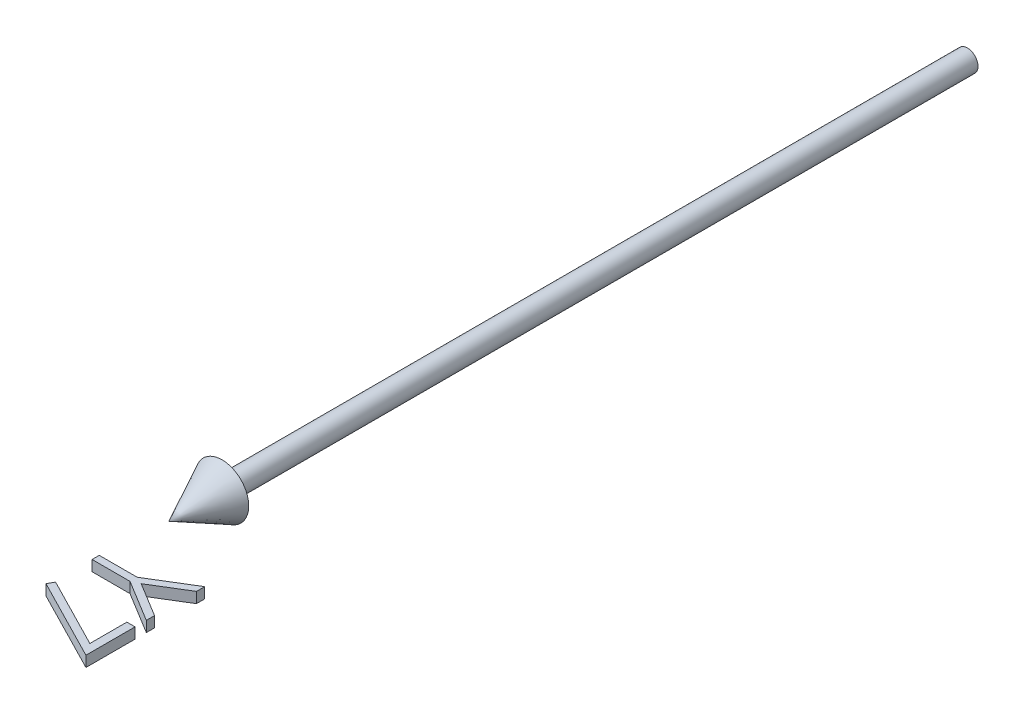
ISO-10303-21;
HEADER;
FILE_DESCRIPTION(('STEP AP214'),'2;1');
FILE_NAME('part.step','',(''),(''),'','','');
FILE_SCHEMA(('AUTOMOTIVE_DESIGN { 1 0 10303 214 1 1 1 1 }'));
ENDSEC;
DATA;
#1=APPLICATION_CONTEXT('core data for automotive mechanical design processes');
#2=APPLICATION_PROTOCOL_DEFINITION('international standard','automotive_design',2000,#1);
#3=PRODUCT_CONTEXT('',#1,'mechanical');
#4=PRODUCT('Part','Part','',(#3));
#5=PRODUCT_RELATED_PRODUCT_CATEGORY('part','',(#4));
#6=PRODUCT_DEFINITION_FORMATION('','',#4);
#7=PRODUCT_DEFINITION_CONTEXT('part definition',#1,'design');
#8=PRODUCT_DEFINITION('design','',#6,#7);
#9=PRODUCT_DEFINITION_SHAPE('','',#8);
#10=(LENGTH_UNIT() NAMED_UNIT(*) SI_UNIT(.MILLI.,.METRE.));
#11=(NAMED_UNIT(*) PLANE_ANGLE_UNIT() SI_UNIT($,.RADIAN.));
#12=(NAMED_UNIT(*) SI_UNIT($,.STERADIAN.) SOLID_ANGLE_UNIT());
#13=UNCERTAINTY_MEASURE_WITH_UNIT(LENGTH_MEASURE(1.E-05),#10,'distance_accuracy_value','');
#14=(GEOMETRIC_REPRESENTATION_CONTEXT(3) GLOBAL_UNCERTAINTY_ASSIGNED_CONTEXT((#13)) GLOBAL_UNIT_ASSIGNED_CONTEXT((#10,
#11,#12)) REPRESENTATION_CONTEXT('',''));
#15=CARTESIAN_POINT('',(0.,0.,0.));
#16=DIRECTION('',(0.,0.,1.));
#17=DIRECTION('',(1.,0.,0.));
#18=AXIS2_PLACEMENT_3D('',#15,#16,#17);
#19=CARTESIAN_POINT('',(13.4615384615385,1.,171.346153846154));
#20=DIRECTION('',(0.,0.,-1.));
#21=DIRECTION('',(-1.,0.,0.));
#22=AXIS2_PLACEMENT_3D('',#19,#20,#21);
#23=PLANE('',#22);
#24=DIRECTION('',(0.,-1.,0.));
#25=VECTOR('',#24,1.);
#26=CARTESIAN_POINT('',(15.,1.,171.346153846154));
#27=LINE('',#26,#25);
#28=CARTESIAN_POINT('',(15.,1.,171.346153846154));
#29=VERTEX_POINT('',#28);
#30=CARTESIAN_POINT('',(15.,-1.,171.346153846154));
#31=VERTEX_POINT('',#30);
#32=EDGE_CURVE('E49',#29,#31,#27,.T.);
#33=ORIENTED_EDGE('',*,*,#32,.T.);
#34=DIRECTION('',(1.,0.,0.));
#35=VECTOR('',#34,1.);
#36=CARTESIAN_POINT('',(13.4615384615385,-1.,171.346153846154));
#37=LINE('',#36,#35);
#38=CARTESIAN_POINT('',(13.4615384615385,-1.,171.346153846154));
#39=VERTEX_POINT('',#38);
#40=EDGE_CURVE('E98',#39,#31,#37,.T.);
#41=ORIENTED_EDGE('',*,*,#40,.F.);
#42=DIRECTION('',(0.,-1.,0.));
#43=VECTOR('',#42,1.);
#44=CARTESIAN_POINT('',(13.4615384615385,1.,171.346153846154));
#45=LINE('',#44,#43);
#46=CARTESIAN_POINT('',(13.4615384615385,1.,171.346153846154));
#47=VERTEX_POINT('',#46);
#48=EDGE_CURVE('E12',#47,#39,#45,.T.);
#49=ORIENTED_EDGE('',*,*,#48,.F.);
#50=DIRECTION('',(1.,0.,0.));
#51=VECTOR('',#50,1.);
#52=CARTESIAN_POINT('',(13.4615384615385,1.,171.346153846154));
#53=LINE('',#52,#51);
#54=EDGE_CURVE('E99',#47,#29,#53,.T.);
#55=ORIENTED_EDGE('',*,*,#54,.T.);
#56=EDGE_LOOP('',(#33,#41,#49,#55));
#57=FACE_BOUND('',#56,.T.);
#58=ADVANCED_FACE('F46',(#57),#23,.T.);
#59=CARTESIAN_POINT('',(13.4615384615385,1.,178.299278846154));
#60=DIRECTION('',(-1.,0.,0.));
#61=DIRECTION('',(0.,0.,1.));
#62=AXIS2_PLACEMENT_3D('',#59,#60,#61);
#63=PLANE('',#62);
#64=ORIENTED_EDGE('',*,*,#48,.T.);
#65=DIRECTION('',(0.,0.,-1.));
#66=VECTOR('',#65,1.);
#67=CARTESIAN_POINT('',(13.4615384615385,-1.,178.299278846154));
#68=LINE('',#67,#66);
#69=CARTESIAN_POINT('',(13.4615384615385,-1.,178.299278846154));
#70=VERTEX_POINT('',#69);
#71=EDGE_CURVE('E116',#70,#39,#68,.T.);
#72=ORIENTED_EDGE('',*,*,#71,.F.);
#73=DIRECTION('',(0.,-1.,0.));
#74=VECTOR('',#73,1.);
#75=CARTESIAN_POINT('',(13.4615384615385,1.,178.299278846154));
#76=LINE('',#75,#74);
#77=CARTESIAN_POINT('',(13.4615384615385,1.,178.299278846154));
#78=VERTEX_POINT('',#77);
#79=EDGE_CURVE('E54',#78,#70,#76,.T.);
#80=ORIENTED_EDGE('',*,*,#79,.F.);
#81=DIRECTION('',(0.,0.,-1.));
#82=VECTOR('',#81,1.);
#83=CARTESIAN_POINT('',(13.4615384615385,1.,178.299278846154));
#84=LINE('',#83,#82);
#85=EDGE_CURVE('E104',#78,#47,#84,.T.);
#86=ORIENTED_EDGE('',*,*,#85,.T.);
#87=EDGE_LOOP('',(#64,#72,#80,#86));
#88=FACE_BOUND('',#87,.T.);
#89=ADVANCED_FACE('F156',(#88),#63,.T.);
#90=CARTESIAN_POINT('',(0.255408653846154,1.,171.529447115385));
#91=DIRECTION('',(0.456180989989926,0.,-0.889887017756643));
#92=DIRECTION('',(-0.889887017756643,0.,-0.456180989989926));
#93=AXIS2_PLACEMENT_3D('',#90,#91,#92);
#94=PLANE('',#93);
#95=ORIENTED_EDGE('',*,*,#79,.T.);
#96=DIRECTION('',(0.889887017756643,0.,0.456180989989926));
#97=VECTOR('',#96,1.);
#98=CARTESIAN_POINT('',(0.255408653846154,-1.,171.529447115385));
#99=LINE('',#98,#97);
#100=CARTESIAN_POINT('',(0.255408653846154,-1.,171.529447115385));
#101=VERTEX_POINT('',#100);
#102=EDGE_CURVE('E123',#101,#70,#99,.T.);
#103=ORIENTED_EDGE('',*,*,#102,.F.);
#104=DIRECTION('',(0.,-1.,0.));
#105=VECTOR('',#104,1.);
#106=CARTESIAN_POINT('',(0.255408653846154,1.,171.529447115385));
#107=LINE('',#106,#105);
#108=CARTESIAN_POINT('',(0.255408653846154,1.,171.529447115385));
#109=VERTEX_POINT('',#108);
#110=EDGE_CURVE('E139',#109,#101,#107,.T.);
#111=ORIENTED_EDGE('',*,*,#110,.F.);
#112=DIRECTION('',(0.889887017756643,0.,0.456180989989926));
#113=VECTOR('',#112,1.);
#114=CARTESIAN_POINT('',(0.255408653846154,1.,171.529447115385));
#115=LINE('',#114,#113);
#116=EDGE_CURVE('E135',#109,#78,#115,.T.);
#117=ORIENTED_EDGE('',*,*,#116,.T.);
#118=EDGE_LOOP('',(#95,#103,#111,#117));
#119=FACE_BOUND('',#118,.T.);
#120=ADVANCED_FACE('F152',(#119),#94,.T.);
#121=CARTESIAN_POINT('',(-0.384615384615385,1.,172.692307692308));
#122=DIRECTION('',(-0.876072484374681,0.,-0.482179429384513));
#123=DIRECTION('',(-0.482179429384513,0.,0.876072484374681));
#124=AXIS2_PLACEMENT_3D('',#121,#122,#123);
#125=PLANE('',#124);
#126=ORIENTED_EDGE('',*,*,#110,.T.);
#127=DIRECTION('',(0.482179429384513,0.,-0.876072484374681));
#128=VECTOR('',#127,1.);
#129=CARTESIAN_POINT('',(-0.384615384615385,-1.,172.692307692308));
#130=LINE('',#129,#128);
#131=CARTESIAN_POINT('',(-0.384615384615385,-1.,172.692307692308));
#132=VERTEX_POINT('',#131);
#133=EDGE_CURVE('E120',#132,#101,#130,.T.);
#134=ORIENTED_EDGE('',*,*,#133,.F.);
#135=DIRECTION('',(0.,-1.,0.));
#136=VECTOR('',#135,1.);
#137=CARTESIAN_POINT('',(-0.384615384615385,1.,172.692307692308));
#138=LINE('',#137,#136);
#139=CARTESIAN_POINT('',(-0.384615384615385,1.,172.692307692308));
#140=VERTEX_POINT('',#139);
#141=EDGE_CURVE('E141',#140,#132,#138,.T.);
#142=ORIENTED_EDGE('',*,*,#141,.F.);
#143=DIRECTION('',(0.482179429384513,0.,-0.876072484374681));
#144=VECTOR('',#143,1.);
#145=CARTESIAN_POINT('',(-0.384615384615385,1.,172.692307692308));
#146=LINE('',#145,#144);
#147=EDGE_CURVE('E132',#140,#109,#146,.T.);
#148=ORIENTED_EDGE('',*,*,#147,.T.);
#149=EDGE_LOOP('',(#126,#134,#142,#148));
#150=FACE_BOUND('',#149,.T.);
#151=ADVANCED_FACE('F149',(#150),#125,.T.);
#152=CARTESIAN_POINT('',(15.,1.,180.576923076923));
#153=DIRECTION('',(-0.4560907909104,0.,0.889933250556875));
#154=DIRECTION('',(0.889933250556875,0.,0.4560907909104));
#155=AXIS2_PLACEMENT_3D('',#152,#153,#154);
#156=PLANE('',#155);
#157=ORIENTED_EDGE('',*,*,#141,.T.);
#158=DIRECTION('',(-0.889933250556875,0.,-0.4560907909104));
#159=VECTOR('',#158,1.);
#160=CARTESIAN_POINT('',(15.,-1.,180.576923076923));
#161=LINE('',#160,#159);
#162=CARTESIAN_POINT('',(15.,-1.,180.576923076923));
#163=VERTEX_POINT('',#162);
#164=EDGE_CURVE('E111',#163,#132,#161,.T.);
#165=ORIENTED_EDGE('',*,*,#164,.F.);
#166=DIRECTION('',(0.,-1.,0.));
#167=VECTOR('',#166,1.);
#168=CARTESIAN_POINT('',(15.,1.,180.576923076923));
#169=LINE('',#168,#167);
#170=CARTESIAN_POINT('',(15.,1.,180.576923076923));
#171=VERTEX_POINT('',#170);
#172=EDGE_CURVE('E103',#171,#163,#169,.T.);
#173=ORIENTED_EDGE('',*,*,#172,.F.);
#174=DIRECTION('',(-0.889933250556875,0.,-0.4560907909104));
#175=VECTOR('',#174,1.);
#176=CARTESIAN_POINT('',(15.,1.,180.576923076923));
#177=LINE('',#176,#175);
#178=EDGE_CURVE('E129',#171,#140,#177,.T.);
#179=ORIENTED_EDGE('',*,*,#178,.T.);
#180=EDGE_LOOP('',(#157,#165,#173,#179));
#181=FACE_BOUND('',#180,.T.);
#182=ADVANCED_FACE('F143',(#181),#156,.T.);
#183=CARTESIAN_POINT('',(15.,1.,171.346153846154));
#184=DIRECTION('',(1.,0.,0.));
#185=DIRECTION('',(0.,0.,-1.));
#186=AXIS2_PLACEMENT_3D('',#183,#184,#185);
#187=PLANE('',#186);
#188=ORIENTED_EDGE('',*,*,#172,.T.);
#189=DIRECTION('',(0.,0.,1.));
#190=VECTOR('',#189,1.);
#191=CARTESIAN_POINT('',(15.,-1.,171.346153846154));
#192=LINE('',#191,#190);
#193=EDGE_CURVE('E106',#31,#163,#192,.T.);
#194=ORIENTED_EDGE('',*,*,#193,.F.);
#195=ORIENTED_EDGE('',*,*,#32,.F.);
#196=DIRECTION('',(0.,0.,1.));
#197=VECTOR('',#196,1.);
#198=CARTESIAN_POINT('',(15.,1.,171.346153846154));
#199=LINE('',#198,#197);
#200=EDGE_CURVE('E127',#29,#171,#199,.T.);
#201=ORIENTED_EDGE('',*,*,#200,.T.);
#202=EDGE_LOOP('',(#188,#194,#195,#201));
#203=FACE_BOUND('',#202,.T.);
#204=ADVANCED_FACE('F107',(#203),#187,.T.);
#205=CARTESIAN_POINT('',(0.,1.,0.));
#206=DIRECTION('',(0.,-1.,0.));
#207=DIRECTION('',(0.,0.,-1.));
#208=AXIS2_PLACEMENT_3D('',#205,#206,#207);
#209=PLANE('',#208);
#210=ORIENTED_EDGE('',*,*,#54,.F.);
#211=ORIENTED_EDGE('',*,*,#85,.F.);
#212=ORIENTED_EDGE('',*,*,#116,.F.);
#213=ORIENTED_EDGE('',*,*,#147,.F.);
#214=ORIENTED_EDGE('',*,*,#178,.F.);
#215=ORIENTED_EDGE('',*,*,#200,.F.);
#216=EDGE_LOOP('',(#210,#211,#212,#213,#214,#215));
#217=FACE_BOUND('',#216,.T.);
#218=ADVANCED_FACE('F155',(#217),#209,.F.);
#219=CARTESIAN_POINT('',(0.,-1.,0.));
#220=DIRECTION('',(0.,-1.,0.));
#221=DIRECTION('',(0.,0.,-1.));
#222=AXIS2_PLACEMENT_3D('',#219,#220,#221);
#223=PLANE('',#222);
#224=ORIENTED_EDGE('',*,*,#40,.T.);
#225=ORIENTED_EDGE('',*,*,#193,.T.);
#226=ORIENTED_EDGE('',*,*,#164,.T.);
#227=ORIENTED_EDGE('',*,*,#133,.T.);
#228=ORIENTED_EDGE('',*,*,#102,.T.);
#229=ORIENTED_EDGE('',*,*,#71,.T.);
#230=EDGE_LOOP('',(#224,#225,#226,#227,#228,#229));
#231=FACE_BOUND('',#230,.T.);
#232=ADVANCED_FACE('F114',(#231),#223,.T.);
#233=CLOSED_SHELL('',(#58,#89,#120,#151,#182,#204,#218,#232));
#234=MANIFOLD_SOLID_BREP('B2',#233);
#235=CARTESIAN_POINT('',(7.13040865384615,1.,163.076923076923));
#236=DIRECTION('',(-0.521331386880885,0.,-0.853354313900652));
#237=DIRECTION('',(-0.853354313900652,0.,0.521331386880885));
#238=AXIS2_PLACEMENT_3D('',#235,#236,#237);
#239=PLANE('',#238);
#240=DIRECTION('',(0.,-1.,0.));
#241=VECTOR('',#240,1.);
#242=CARTESIAN_POINT('',(15.,1.,158.269230769231));
#243=LINE('',#242,#241);
#244=CARTESIAN_POINT('',(15.,1.,158.269230769231));
#245=VERTEX_POINT('',#244);
#246=CARTESIAN_POINT('',(15.,-1.,158.269230769231));
#247=VERTEX_POINT('',#246);
#248=EDGE_CURVE('E258',#245,#247,#243,.T.);
#249=ORIENTED_EDGE('',*,*,#248,.T.);
#250=DIRECTION('',(0.853354313900652,0.,-0.521331386880885));
#251=VECTOR('',#250,1.);
#252=CARTESIAN_POINT('',(7.13040865384615,-1.,163.076923076923));
#253=LINE('',#252,#251);
#254=CARTESIAN_POINT('',(7.13040865384615,-1.,163.076923076923));
#255=VERTEX_POINT('',#254);
#256=EDGE_CURVE('E325',#255,#247,#253,.T.);
#257=ORIENTED_EDGE('',*,*,#256,.F.);
#258=DIRECTION('',(0.,-1.,0.));
#259=VECTOR('',#258,1.);
#260=CARTESIAN_POINT('',(7.13040865384615,1.,163.076923076923));
#261=LINE('',#260,#259);
#262=CARTESIAN_POINT('',(7.13040865384615,1.,163.076923076923));
#263=VERTEX_POINT('',#262);
#264=EDGE_CURVE('E44',#263,#255,#261,.T.);
#265=ORIENTED_EDGE('',*,*,#264,.F.);
#266=DIRECTION('',(0.853354313900652,0.,-0.521331386880885));
#267=VECTOR('',#266,1.);
#268=CARTESIAN_POINT('',(7.13040865384615,1.,163.076923076923));
#269=LINE('',#268,#267);
#270=EDGE_CURVE('E326',#263,#245,#269,.T.);
#271=ORIENTED_EDGE('',*,*,#270,.T.);
#272=EDGE_LOOP('',(#249,#257,#265,#271));
#273=FACE_BOUND('',#272,.T.);
#274=ADVANCED_FACE('F255',(#273),#239,.T.);
#275=CARTESIAN_POINT('',(0.,1.,163.076923076923));
#276=DIRECTION('',(0.,0.,-1.));
#277=DIRECTION('',(-1.,0.,0.));
#278=AXIS2_PLACEMENT_3D('',#275,#276,#277);
#279=PLANE('',#278);
#280=ORIENTED_EDGE('',*,*,#264,.T.);
#281=DIRECTION('',(1.,0.,0.));
#282=VECTOR('',#281,1.);
#283=CARTESIAN_POINT('',(0.,-1.,163.076923076923));
#284=LINE('',#283,#282);
#285=CARTESIAN_POINT('',(0.,-1.,163.076923076923));
#286=VERTEX_POINT('',#285);
#287=EDGE_CURVE('E343',#286,#255,#284,.T.);
#288=ORIENTED_EDGE('',*,*,#287,.F.);
#289=DIRECTION('',(0.,-1.,0.));
#290=VECTOR('',#289,1.);
#291=CARTESIAN_POINT('',(0.,1.,163.076923076923));
#292=LINE('',#291,#290);
#293=CARTESIAN_POINT('',(0.,1.,163.076923076923));
#294=VERTEX_POINT('',#293);
#295=EDGE_CURVE('E263',#294,#286,#292,.T.);
#296=ORIENTED_EDGE('',*,*,#295,.F.);
#297=DIRECTION('',(1.,0.,0.));
#298=VECTOR('',#297,1.);
#299=CARTESIAN_POINT('',(0.,1.,163.076923076923));
#300=LINE('',#299,#298);
#301=EDGE_CURVE('E331',#294,#263,#300,.T.);
#302=ORIENTED_EDGE('',*,*,#301,.T.);
#303=EDGE_LOOP('',(#280,#288,#296,#302));
#304=FACE_BOUND('',#303,.T.);
#305=ADVANCED_FACE('F419',(#304),#279,.T.);
#306=CARTESIAN_POINT('',(0.,1.,164.423076923077));
#307=DIRECTION('',(-1.,0.,0.));
#308=DIRECTION('',(0.,0.,1.));
#309=AXIS2_PLACEMENT_3D('',#306,#307,#308);
#310=PLANE('',#309);
#311=ORIENTED_EDGE('',*,*,#295,.T.);
#312=DIRECTION('',(0.,0.,-1.));
#313=VECTOR('',#312,1.);
#314=CARTESIAN_POINT('',(0.,-1.,164.423076923077));
#315=LINE('',#314,#313);
#316=CARTESIAN_POINT('',(0.,-1.,164.423076923077));
#317=VERTEX_POINT('',#316);
#318=EDGE_CURVE('E359',#317,#286,#315,.T.);
#319=ORIENTED_EDGE('',*,*,#318,.F.);
#320=DIRECTION('',(0.,-1.,0.));
#321=VECTOR('',#320,1.);
#322=CARTESIAN_POINT('',(0.,1.,164.423076923077));
#323=LINE('',#322,#321);
#324=CARTESIAN_POINT('',(0.,1.,164.423076923077));
#325=VERTEX_POINT('',#324);
#326=EDGE_CURVE('E384',#325,#317,#323,.T.);
#327=ORIENTED_EDGE('',*,*,#326,.F.);
#328=DIRECTION('',(0.,0.,-1.));
#329=VECTOR('',#328,1.);
#330=CARTESIAN_POINT('',(0.,1.,164.423076923077));
#331=LINE('',#330,#329);
#332=EDGE_CURVE('E380',#325,#294,#331,.T.);
#333=ORIENTED_EDGE('',*,*,#332,.T.);
#334=EDGE_LOOP('',(#311,#319,#327,#333));
#335=FACE_BOUND('',#334,.T.);
#336=ADVANCED_FACE('F417',(#335),#310,.T.);
#337=CARTESIAN_POINT('',(7.13040865384615,1.,164.423076923077));
#338=DIRECTION('',(0.,0.,1.));
#339=DIRECTION('',(1.,0.,0.));
#340=AXIS2_PLACEMENT_3D('',#337,#338,#339);
#341=PLANE('',#340);
#342=ORIENTED_EDGE('',*,*,#326,.T.);
#343=DIRECTION('',(-1.,0.,0.));
#344=VECTOR('',#343,1.);
#345=CARTESIAN_POINT('',(7.13040865384615,-1.,164.423076923077));
#346=LINE('',#345,#344);
#347=CARTESIAN_POINT('',(7.13040865384615,-1.,164.423076923077));
#348=VERTEX_POINT('',#347);
#349=EDGE_CURVE('E356',#348,#317,#346,.T.);
#350=ORIENTED_EDGE('',*,*,#349,.F.);
#351=DIRECTION('',(0.,-1.,0.));
#352=VECTOR('',#351,1.);
#353=CARTESIAN_POINT('',(7.13040865384615,1.,164.423076923077));
#354=LINE('',#353,#352);
#355=CARTESIAN_POINT('',(7.13040865384615,1.,164.423076923077));
#356=VERTEX_POINT('',#355);
#357=EDGE_CURVE('E386',#356,#348,#354,.T.);
#358=ORIENTED_EDGE('',*,*,#357,.F.);
#359=DIRECTION('',(-1.,0.,0.));
#360=VECTOR('',#359,1.);
#361=CARTESIAN_POINT('',(7.13040865384615,1.,164.423076923077));
#362=LINE('',#361,#360);
#363=EDGE_CURVE('E377',#356,#325,#362,.T.);
#364=ORIENTED_EDGE('',*,*,#363,.T.);
#365=EDGE_LOOP('',(#342,#350,#358,#364));
#366=FACE_BOUND('',#365,.T.);
#367=ADVANCED_FACE('F415',(#366),#341,.T.);
#368=CARTESIAN_POINT('',(15.,1.,169.230769230769));
#369=DIRECTION('',(-0.521331386880888,0.,0.853354313900651));
#370=DIRECTION('',(0.853354313900651,0.,0.521331386880888));
#371=AXIS2_PLACEMENT_3D('',#368,#369,#370);
#372=PLANE('',#371);
#373=ORIENTED_EDGE('',*,*,#357,.T.);
#374=DIRECTION('',(-0.853354313900651,0.,-0.521331386880888));
#375=VECTOR('',#374,1.);
#376=CARTESIAN_POINT('',(15.,-1.,169.230769230769));
#377=LINE('',#376,#375);
#378=CARTESIAN_POINT('',(15.,-1.,169.230769230769));
#379=VERTEX_POINT('',#378);
#380=EDGE_CURVE('E353',#379,#348,#377,.T.);
#381=ORIENTED_EDGE('',*,*,#380,.F.);
#382=DIRECTION('',(0.,-1.,0.));
#383=VECTOR('',#382,1.);
#384=CARTESIAN_POINT('',(15.,1.,169.230769230769));
#385=LINE('',#384,#383);
#386=CARTESIAN_POINT('',(15.,1.,169.230769230769));
#387=VERTEX_POINT('',#386);
#388=EDGE_CURVE('E388',#387,#379,#385,.T.);
#389=ORIENTED_EDGE('',*,*,#388,.F.);
#390=DIRECTION('',(-0.853354313900651,0.,-0.521331386880888));
#391=VECTOR('',#390,1.);
#392=CARTESIAN_POINT('',(15.,1.,169.230769230769));
#393=LINE('',#392,#391);
#394=EDGE_CURVE('E374',#387,#356,#393,.T.);
#395=ORIENTED_EDGE('',*,*,#394,.T.);
#396=EDGE_LOOP('',(#373,#381,#389,#395));
#397=FACE_BOUND('',#396,.T.);
#398=ADVANCED_FACE('F410',(#397),#372,.T.);
#399=CARTESIAN_POINT('',(15.,1.,167.689302884615));
#400=DIRECTION('',(1.,0.,0.));
#401=DIRECTION('',(0.,0.,-1.));
#402=AXIS2_PLACEMENT_3D('',#399,#400,#401);
#403=PLANE('',#402);
#404=ORIENTED_EDGE('',*,*,#388,.T.);
#405=DIRECTION('',(0.,0.,1.));
#406=VECTOR('',#405,1.);
#407=CARTESIAN_POINT('',(15.,-1.,167.689302884615));
#408=LINE('',#407,#406);
#409=CARTESIAN_POINT('',(15.,-1.,167.689302884615));
#410=VERTEX_POINT('',#409);
#411=EDGE_CURVE('E350',#410,#379,#408,.T.);
#412=ORIENTED_EDGE('',*,*,#411,.F.);
#413=DIRECTION('',(0.,-1.,0.));
#414=VECTOR('',#413,1.);
#415=CARTESIAN_POINT('',(15.,1.,167.689302884615));
#416=LINE('',#415,#414);
#417=CARTESIAN_POINT('',(15.,1.,167.689302884615));
#418=VERTEX_POINT('',#417);
#419=EDGE_CURVE('E390',#418,#410,#416,.T.);
#420=ORIENTED_EDGE('',*,*,#419,.F.);
#421=DIRECTION('',(0.,0.,1.));
#422=VECTOR('',#421,1.);
#423=CARTESIAN_POINT('',(15.,1.,167.689302884615));
#424=LINE('',#423,#422);
#425=EDGE_CURVE('E371',#418,#387,#424,.T.);
#426=ORIENTED_EDGE('',*,*,#425,.T.);
#427=EDGE_LOOP('',(#404,#412,#420,#426));
#428=FACE_BOUND('',#427,.T.);
#429=ADVANCED_FACE('F403',(#428),#403,.T.);
#430=CARTESIAN_POINT('',(8.5546875,1.,163.753004807692));
#431=DIRECTION('',(0.52120858483258,0.,-0.853429324019757));
#432=DIRECTION('',(-0.853429324019757,0.,-0.52120858483258));
#433=AXIS2_PLACEMENT_3D('',#430,#431,#432);
#434=PLANE('',#433);
#435=ORIENTED_EDGE('',*,*,#419,.T.);
#436=DIRECTION('',(0.853429324019757,0.,0.52120858483258));
#437=VECTOR('',#436,1.);
#438=CARTESIAN_POINT('',(8.5546875,-1.,163.753004807692));
#439=LINE('',#438,#437);
#440=CARTESIAN_POINT('',(8.5546875,-1.,163.753004807692));
#441=VERTEX_POINT('',#440);
#442=EDGE_CURVE('E347',#441,#410,#439,.T.);
#443=ORIENTED_EDGE('',*,*,#442,.F.);
#444=DIRECTION('',(0.,-1.,0.));
#445=VECTOR('',#444,1.);
#446=CARTESIAN_POINT('',(8.5546875,1.,163.753004807692));
#447=LINE('',#446,#445);
#448=CARTESIAN_POINT('',(8.5546875,1.,163.753004807692));
#449=VERTEX_POINT('',#448);
#450=EDGE_CURVE('E392',#449,#441,#447,.T.);
#451=ORIENTED_EDGE('',*,*,#450,.F.);
#452=DIRECTION('',(0.853429324019757,0.,0.52120858483258));
#453=VECTOR('',#452,1.);
#454=CARTESIAN_POINT('',(8.5546875,1.,163.753004807692));
#455=LINE('',#454,#453);
#456=EDGE_CURVE('E368',#449,#418,#455,.T.);
#457=ORIENTED_EDGE('',*,*,#456,.T.);
#458=EDGE_LOOP('',(#435,#443,#451,#457));
#459=FACE_BOUND('',#458,.T.);
#460=ADVANCED_FACE('F400',(#459),#434,.T.);
#461=CARTESIAN_POINT('',(15.,1.,159.810697115385));
#462=DIRECTION('',(0.521787793651244,0.,0.853075318126463));
#463=DIRECTION('',(0.853075318126463,0.,-0.521787793651244));
#464=AXIS2_PLACEMENT_3D('',#461,#462,#463);
#465=PLANE('',#464);
#466=ORIENTED_EDGE('',*,*,#450,.T.);
#467=DIRECTION('',(-0.853075318126463,0.,0.521787793651244));
#468=VECTOR('',#467,1.);
#469=CARTESIAN_POINT('',(15.,-1.,159.810697115385));
#470=LINE('',#469,#468);
#471=CARTESIAN_POINT('',(15.,-1.,159.810697115385));
#472=VERTEX_POINT('',#471);
#473=EDGE_CURVE('E338',#472,#441,#470,.T.);
#474=ORIENTED_EDGE('',*,*,#473,.F.);
#475=DIRECTION('',(0.,-1.,0.));
#476=VECTOR('',#475,1.);
#477=CARTESIAN_POINT('',(15.,1.,159.810697115385));
#478=LINE('',#477,#476);
#479=CARTESIAN_POINT('',(15.,1.,159.810697115385));
#480=VERTEX_POINT('',#479);
#481=EDGE_CURVE('E330',#480,#472,#478,.T.);
#482=ORIENTED_EDGE('',*,*,#481,.F.);
#483=DIRECTION('',(-0.853075318126463,0.,0.521787793651244));
#484=VECTOR('',#483,1.);
#485=CARTESIAN_POINT('',(15.,1.,159.810697115385));
#486=LINE('',#485,#484);
#487=EDGE_CURVE('E365',#480,#449,#486,.T.);
#488=ORIENTED_EDGE('',*,*,#487,.T.);
#489=EDGE_LOOP('',(#466,#474,#482,#488));
#490=FACE_BOUND('',#489,.T.);
#491=ADVANCED_FACE('F394',(#490),#465,.T.);
#492=CARTESIAN_POINT('',(15.,1.,158.269230769231));
#493=DIRECTION('',(1.,0.,0.));
#494=DIRECTION('',(0.,0.,-1.));
#495=AXIS2_PLACEMENT_3D('',#492,#493,#494);
#496=PLANE('',#495);
#497=ORIENTED_EDGE('',*,*,#481,.T.);
#498=DIRECTION('',(0.,0.,1.));
#499=VECTOR('',#498,1.);
#500=CARTESIAN_POINT('',(15.,-1.,158.269230769231));
#501=LINE('',#500,#499);
#502=EDGE_CURVE('E333',#247,#472,#501,.T.);
#503=ORIENTED_EDGE('',*,*,#502,.F.);
#504=ORIENTED_EDGE('',*,*,#248,.F.);
#505=DIRECTION('',(0.,0.,1.));
#506=VECTOR('',#505,1.);
#507=CARTESIAN_POINT('',(15.,1.,158.269230769231));
#508=LINE('',#507,#506);
#509=EDGE_CURVE('E363',#245,#480,#508,.T.);
#510=ORIENTED_EDGE('',*,*,#509,.T.);
#511=EDGE_LOOP('',(#497,#503,#504,#510));
#512=FACE_BOUND('',#511,.T.);
#513=ADVANCED_FACE('F334',(#512),#496,.T.);
#514=CARTESIAN_POINT('',(0.,1.,0.));
#515=DIRECTION('',(0.,1.,0.));
#516=DIRECTION('',(0.,0.,1.));
#517=AXIS2_PLACEMENT_3D('',#514,#515,#516);
#518=PLANE('',#517);
#519=ORIENTED_EDGE('',*,*,#270,.F.);
#520=ORIENTED_EDGE('',*,*,#301,.F.);
#521=ORIENTED_EDGE('',*,*,#332,.F.);
#522=ORIENTED_EDGE('',*,*,#363,.F.);
#523=ORIENTED_EDGE('',*,*,#394,.F.);
#524=ORIENTED_EDGE('',*,*,#425,.F.);
#525=ORIENTED_EDGE('',*,*,#456,.F.);
#526=ORIENTED_EDGE('',*,*,#487,.F.);
#527=ORIENTED_EDGE('',*,*,#509,.F.);
#528=EDGE_LOOP('',(#519,#520,#521,#522,#523,#524,#525,#526,#527));
#529=FACE_BOUND('',#528,.T.);
#530=ADVANCED_FACE('F406',(#529),#518,.T.);
#531=CARTESIAN_POINT('',(0.,-1.,0.));
#532=DIRECTION('',(0.,1.,0.));
#533=DIRECTION('',(0.,0.,1.));
#534=AXIS2_PLACEMENT_3D('',#531,#532,#533);
#535=PLANE('',#534);
#536=ORIENTED_EDGE('',*,*,#256,.T.);
#537=ORIENTED_EDGE('',*,*,#502,.T.);
#538=ORIENTED_EDGE('',*,*,#473,.T.);
#539=ORIENTED_EDGE('',*,*,#442,.T.);
#540=ORIENTED_EDGE('',*,*,#411,.T.);
#541=ORIENTED_EDGE('',*,*,#380,.T.);
#542=ORIENTED_EDGE('',*,*,#349,.T.);
#543=ORIENTED_EDGE('',*,*,#318,.T.);
#544=ORIENTED_EDGE('',*,*,#287,.T.);
#545=EDGE_LOOP('',(#536,#537,#538,#539,#540,#541,#542,#543,#544));
#546=FACE_BOUND('',#545,.T.);
#547=ADVANCED_FACE('F341',(#546),#535,.F.);
#548=CLOSED_SHELL('',(#274,#305,#336,#367,#398,#429,#460,#491,#513,#530,#547));
#549=MANIFOLD_SOLID_BREP('B6',#548);
#550=CARTESIAN_POINT('',(2.,0.,0.));
#551=DIRECTION('',(0.,0.,1.));
#552=DIRECTION('',(1.,0.,0.));
#553=AXIS2_PLACEMENT_3D('',#550,#551,#552);
#554=PLANE('',#553);
#555=CARTESIAN_POINT('',(0.,0.,0.));
#556=DIRECTION('',(0.,0.,-1.));
#557=DIRECTION('',(-1.,0.,0.));
#558=AXIS2_PLACEMENT_3D('',#555,#556,#557);
#559=CIRCLE('',#558,2.);
#560=CARTESIAN_POINT('',(-2.,0.,0.));
#561=VERTEX_POINT('',#560);
#562=EDGE_CURVE('E253',#561,#561,#559,.T.);
#563=ORIENTED_EDGE('',*,*,#562,.T.);
#564=EDGE_LOOP('',(#563));
#565=FACE_BOUND('',#564,.T.);
#566=ADVANCED_FACE('F509',(#565),#554,.F.);
#567=CARTESIAN_POINT('',(0.,0.,-41.9499520246458));
#568=DIRECTION('',(0.,0.,-1.));
#569=DIRECTION('',(-1.,0.,0.));
#570=AXIS2_PLACEMENT_3D('',#567,#568,#569);
#571=CYLINDRICAL_SURFACE('',#570,2.);
#572=ORIENTED_EDGE('',*,*,#562,.F.);
#573=EDGE_LOOP('',(#572));
#574=FACE_BOUND('',#573,.T.);
#575=CARTESIAN_POINT('',(0.,0.,140.));
#576=DIRECTION('',(0.,0.,-1.));
#577=DIRECTION('',(-1.,0.,0.));
#578=AXIS2_PLACEMENT_3D('',#575,#576,#577);
#579=CIRCLE('',#578,2.);
#580=CARTESIAN_POINT('',(-2.,0.,140.));
#581=VERTEX_POINT('',#580);
#582=EDGE_CURVE('E515',#581,#581,#579,.T.);
#583=ORIENTED_EDGE('',*,*,#582,.T.);
#584=EDGE_LOOP('',(#583));
#585=FACE_BOUND('',#584,.T.);
#586=ADVANCED_FACE('F526',(#574,#585),#571,.T.);
#587=CARTESIAN_POINT('',(5.00000000000002,0.,140.));
#588=DIRECTION('',(0.,0.,1.));
#589=DIRECTION('',(1.,0.,0.));
#590=AXIS2_PLACEMENT_3D('',#587,#588,#589);
#591=PLANE('',#590);
#592=ORIENTED_EDGE('',*,*,#582,.F.);
#593=EDGE_LOOP('',(#592));
#594=FACE_BOUND('',#593,.T.);
#595=CARTESIAN_POINT('',(0.,0.,140.));
#596=DIRECTION('',(0.,0.,-1.));
#597=DIRECTION('',(-1.,0.,0.));
#598=AXIS2_PLACEMENT_3D('',#595,#596,#597);
#599=CIRCLE('',#598,5.00000000000002);
#600=CARTESIAN_POINT('',(-5.00000000000002,0.,140.));
#601=VERTEX_POINT('',#600);
#602=EDGE_CURVE('E540',#601,#601,#599,.T.);
#603=ORIENTED_EDGE('',*,*,#602,.T.);
#604=EDGE_LOOP('',(#603));
#605=FACE_BOUND('',#604,.T.);
#606=ADVANCED_FACE('F520',(#594,#605),#591,.F.);
#607=CARTESIAN_POINT('',(0.,0.,150.));
#608=DIRECTION('',(0.,0.,-1.));
#609=DIRECTION('',(-1.,0.,0.));
#610=AXIS2_PLACEMENT_3D('',#607,#608,#609);
#611=CONICAL_SURFACE('',#610,0.,0.463647609000806);
#612=ORIENTED_EDGE('',*,*,#602,.F.);
#613=EDGE_LOOP('',(#612));
#614=FACE_BOUND('',#613,.T.);
#615=CARTESIAN_POINT('',(0.,0.,150.));
#616=VERTEX_POINT('',#615);
#617=VERTEX_LOOP('',#616);
#618=FACE_BOUND('',#617,.T.);
#619=ADVANCED_FACE('F518',(#614,#618),#611,.T.);
#620=CLOSED_SHELL('',(#566,#586,#606,#619));
#621=MANIFOLD_SOLID_BREP('B38',#620);
#622=ADVANCED_BREP_SHAPE_REPRESENTATION('',(#18,#234,#549,#621),#14);
#623=SHAPE_DEFINITION_REPRESENTATION(#9,#622);
ENDSEC;
END-ISO-10303-21;
